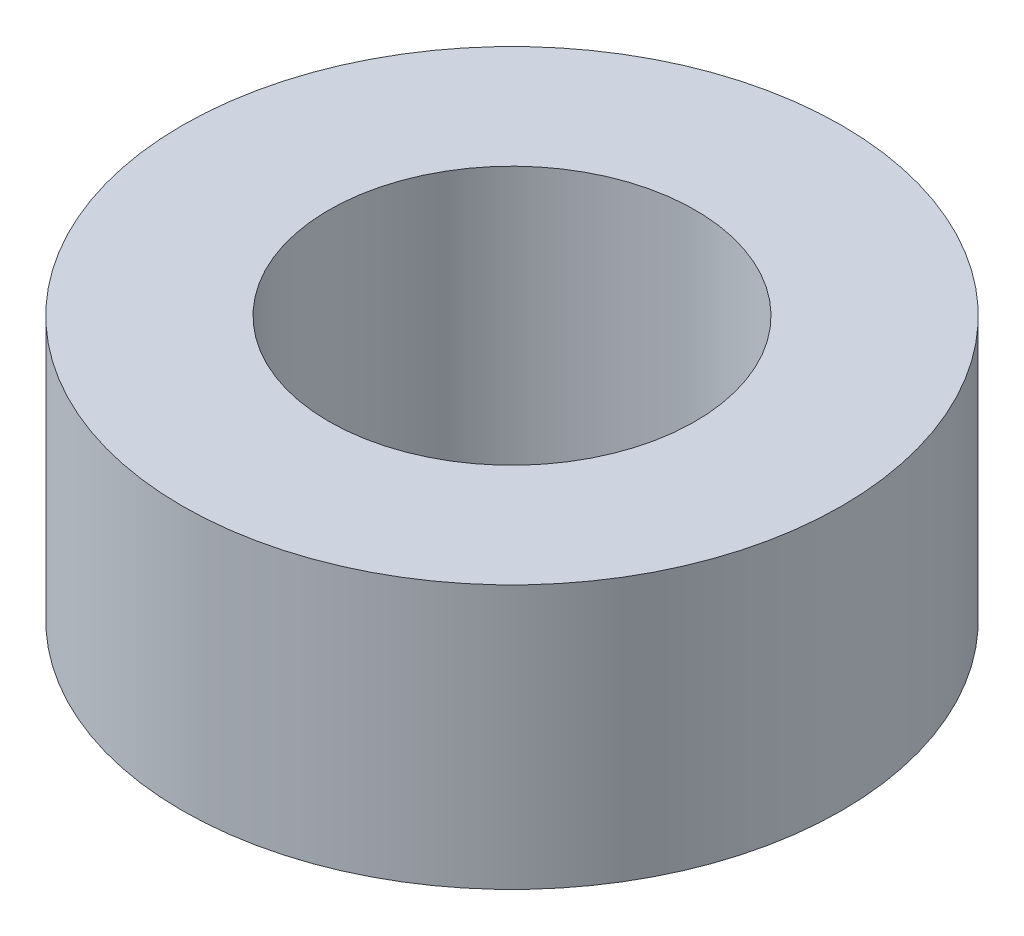
ISO-10303-21;
HEADER;
FILE_DESCRIPTION(('STEP AP214'),'2;1');
FILE_NAME('part.step','',(''),(''),'','','');
FILE_SCHEMA(('AUTOMOTIVE_DESIGN { 1 0 10303 214 1 1 1 1 }'));
ENDSEC;
DATA;
#1=APPLICATION_CONTEXT('core data for automotive mechanical design processes');
#2=APPLICATION_PROTOCOL_DEFINITION('international standard','automotive_design',2000,#1);
#3=PRODUCT_CONTEXT('',#1,'mechanical');
#4=PRODUCT('Part','Part','',(#3));
#5=PRODUCT_RELATED_PRODUCT_CATEGORY('part','',(#4));
#6=PRODUCT_DEFINITION_FORMATION('','',#4);
#7=PRODUCT_DEFINITION_CONTEXT('part definition',#1,'design');
#8=PRODUCT_DEFINITION('design','',#6,#7);
#9=PRODUCT_DEFINITION_SHAPE('','',#8);
#10=(LENGTH_UNIT() NAMED_UNIT(*) SI_UNIT(.MILLI.,.METRE.));
#11=(NAMED_UNIT(*) PLANE_ANGLE_UNIT() SI_UNIT($,.RADIAN.));
#12=(NAMED_UNIT(*) SI_UNIT($,.STERADIAN.) SOLID_ANGLE_UNIT());
#13=UNCERTAINTY_MEASURE_WITH_UNIT(LENGTH_MEASURE(1.E-05),#10,'distance_accuracy_value','');
#14=(GEOMETRIC_REPRESENTATION_CONTEXT(3) GLOBAL_UNCERTAINTY_ASSIGNED_CONTEXT((#13)) GLOBAL_UNIT_ASSIGNED_CONTEXT((#10,
#11,#12)) REPRESENTATION_CONTEXT('',''));
#15=CARTESIAN_POINT('',(0.,0.,0.));
#16=DIRECTION('',(0.,0.,1.));
#17=DIRECTION('',(1.,0.,0.));
#18=AXIS2_PLACEMENT_3D('',#15,#16,#17);
#19=CARTESIAN_POINT('',(0.,18.,0.));
#20=DIRECTION('',(0.,-1.,0.));
#21=DIRECTION('',(0.,0.,-1.));
#22=AXIS2_PLACEMENT_3D('',#19,#20,#21);
#23=CYLINDRICAL_SURFACE('',#22,22.5);
#24=CARTESIAN_POINT('',(0.,18.,0.));
#25=DIRECTION('',(0.,1.,0.));
#26=DIRECTION('',(0.,0.,1.));
#27=AXIS2_PLACEMENT_3D('',#24,#25,#26);
#28=CIRCLE('',#27,22.5);
#29=CARTESIAN_POINT('',(0.,18.,22.5));
#30=VERTEX_POINT('',#29);
#31=EDGE_CURVE('E10',#30,#30,#28,.T.);
#32=ORIENTED_EDGE('',*,*,#31,.F.);
#33=EDGE_LOOP('',(#32));
#34=FACE_BOUND('',#33,.T.);
#35=CARTESIAN_POINT('',(0.,0.,0.));
#36=DIRECTION('',(0.,1.,0.));
#37=DIRECTION('',(0.,0.,1.));
#38=AXIS2_PLACEMENT_3D('',#35,#36,#37);
#39=CIRCLE('',#38,22.5);
#40=CARTESIAN_POINT('',(0.,0.,22.5));
#41=VERTEX_POINT('',#40);
#42=EDGE_CURVE('E37',#41,#41,#39,.T.);
#43=ORIENTED_EDGE('',*,*,#42,.T.);
#44=EDGE_LOOP('',(#43));
#45=FACE_BOUND('',#44,.T.);
#46=ADVANCED_FACE('F40',(#34,#45),#23,.T.);
#47=CARTESIAN_POINT('',(0.,18.,0.));
#48=DIRECTION('',(0.,1.,0.));
#49=DIRECTION('',(0.,0.,1.));
#50=AXIS2_PLACEMENT_3D('',#47,#48,#49);
#51=PLANE('',#50);
#52=CARTESIAN_POINT('',(0.,18.,0.));
#53=DIRECTION('',(0.,1.,0.));
#54=DIRECTION('',(0.,0.,1.));
#55=AXIS2_PLACEMENT_3D('',#52,#53,#54);
#56=CIRCLE('',#55,12.5);
#57=CARTESIAN_POINT('',(0.,18.,12.5));
#58=VERTEX_POINT('',#57);
#59=EDGE_CURVE('E50',#58,#58,#56,.T.);
#60=ORIENTED_EDGE('',*,*,#59,.F.);
#61=EDGE_LOOP('',(#60));
#62=FACE_BOUND('',#61,.T.);
#63=ORIENTED_EDGE('',*,*,#31,.T.);
#64=EDGE_LOOP('',(#63));
#65=FACE_BOUND('',#64,.T.);
#66=ADVANCED_FACE('F59',(#62,#65),#51,.T.);
#67=CARTESIAN_POINT('',(0.,0.,0.));
#68=DIRECTION('',(0.,1.,0.));
#69=DIRECTION('',(0.,0.,1.));
#70=AXIS2_PLACEMENT_3D('',#67,#68,#69);
#71=PLANE('',#70);
#72=CARTESIAN_POINT('',(0.,0.,0.));
#73=DIRECTION('',(0.,1.,0.));
#74=DIRECTION('',(0.,0.,1.));
#75=AXIS2_PLACEMENT_3D('',#72,#73,#74);
#76=CIRCLE('',#75,12.5);
#77=CARTESIAN_POINT('',(0.,0.,12.5));
#78=VERTEX_POINT('',#77);
#79=EDGE_CURVE('E47',#78,#78,#76,.T.);
#80=ORIENTED_EDGE('',*,*,#79,.T.);
#81=EDGE_LOOP('',(#80));
#82=FACE_BOUND('',#81,.T.);
#83=ORIENTED_EDGE('',*,*,#42,.F.);
#84=EDGE_LOOP('',(#83));
#85=FACE_BOUND('',#84,.T.);
#86=ADVANCED_FACE('F58',(#82,#85),#71,.F.);
#87=CARTESIAN_POINT('',(0.,18.,0.));
#88=DIRECTION('',(0.,-1.,0.));
#89=DIRECTION('',(0.,0.,-1.));
#90=AXIS2_PLACEMENT_3D('',#87,#88,#89);
#91=CYLINDRICAL_SURFACE('',#90,12.5);
#92=ORIENTED_EDGE('',*,*,#59,.T.);
#93=EDGE_LOOP('',(#92));
#94=FACE_BOUND('',#93,.T.);
#95=ORIENTED_EDGE('',*,*,#79,.F.);
#96=EDGE_LOOP('',(#95));
#97=FACE_BOUND('',#96,.T.);
#98=ADVANCED_FACE('F54',(#94,#97),#91,.F.);
#99=CLOSED_SHELL('',(#46,#66,#86,#98));
#100=MANIFOLD_SOLID_BREP('B2',#99);
#101=ADVANCED_BREP_SHAPE_REPRESENTATION('',(#18,#100),#14);
#102=SHAPE_DEFINITION_REPRESENTATION(#9,#101);
ENDSEC;
END-ISO-10303-21;
